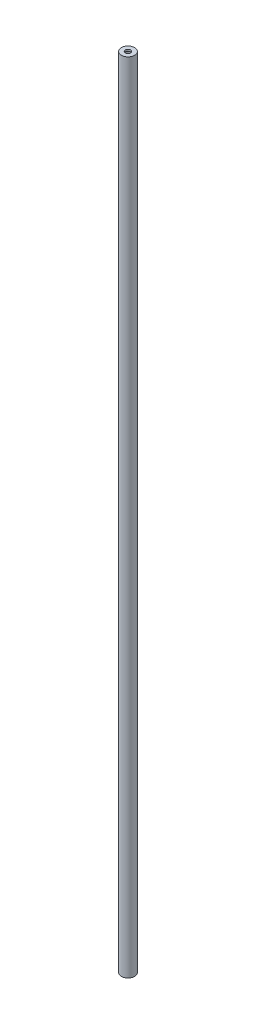
ISO-10303-21;
HEADER;
FILE_DESCRIPTION(('STEP AP214'),'2;1');
FILE_NAME('part.step','',(''),(''),'','','');
FILE_SCHEMA(('AUTOMOTIVE_DESIGN { 1 0 10303 214 1 1 1 1 }'));
ENDSEC;
DATA;
#1=APPLICATION_CONTEXT('core data for automotive mechanical design processes');
#2=APPLICATION_PROTOCOL_DEFINITION('international standard','automotive_design',2000,#1);
#3=PRODUCT_CONTEXT('',#1,'mechanical');
#4=PRODUCT('Part','Part','',(#3));
#5=PRODUCT_RELATED_PRODUCT_CATEGORY('part','',(#4));
#6=PRODUCT_DEFINITION_FORMATION('','',#4);
#7=PRODUCT_DEFINITION_CONTEXT('part definition',#1,'design');
#8=PRODUCT_DEFINITION('design','',#6,#7);
#9=PRODUCT_DEFINITION_SHAPE('','',#8);
#10=(LENGTH_UNIT() NAMED_UNIT(*) SI_UNIT(.MILLI.,.METRE.));
#11=(NAMED_UNIT(*) PLANE_ANGLE_UNIT() SI_UNIT($,.RADIAN.));
#12=(NAMED_UNIT(*) SI_UNIT($,.STERADIAN.) SOLID_ANGLE_UNIT());
#13=UNCERTAINTY_MEASURE_WITH_UNIT(LENGTH_MEASURE(1.E-05),#10,'distance_accuracy_value','');
#14=(GEOMETRIC_REPRESENTATION_CONTEXT(3) GLOBAL_UNCERTAINTY_ASSIGNED_CONTEXT((#13)) GLOBAL_UNIT_ASSIGNED_CONTEXT((#10,
#11,#12)) REPRESENTATION_CONTEXT('',''));
#15=CARTESIAN_POINT('',(0.,0.,0.));
#16=DIRECTION('',(0.,0.,1.));
#17=DIRECTION('',(1.,0.,0.));
#18=AXIS2_PLACEMENT_3D('',#15,#16,#17);
#19=CARTESIAN_POINT('',(0.,900.,0.));
#20=DIRECTION('',(0.,-1.,0.));
#21=DIRECTION('',(0.,0.,-1.));
#22=AXIS2_PLACEMENT_3D('',#19,#20,#21);
#23=CYLINDRICAL_SURFACE('',#22,5.5);
#24=CARTESIAN_POINT('',(0.,898.,0.));
#25=DIRECTION('',(0.,1.,0.));
#26=DIRECTION('',(0.,0.,1.));
#27=AXIS2_PLACEMENT_3D('',#24,#25,#26);
#28=CIRCLE('',#27,5.5);
#29=CARTESIAN_POINT('',(0.,898.,5.5));
#30=VERTEX_POINT('',#29);
#31=EDGE_CURVE('E10',#30,#30,#28,.T.);
#32=ORIENTED_EDGE('',*,*,#31,.T.);
#33=EDGE_LOOP('',(#32));
#34=FACE_BOUND('',#33,.T.);
#35=CARTESIAN_POINT('',(0.,2.,0.));
#36=DIRECTION('',(0.,1.,0.));
#37=DIRECTION('',(0.,0.,1.));
#38=AXIS2_PLACEMENT_3D('',#35,#36,#37);
#39=CIRCLE('',#38,5.5);
#40=CARTESIAN_POINT('',(0.,2.,5.5));
#41=VERTEX_POINT('',#40);
#42=EDGE_CURVE('E51',#41,#41,#39,.T.);
#43=ORIENTED_EDGE('',*,*,#42,.F.);
#44=EDGE_LOOP('',(#43));
#45=FACE_BOUND('',#44,.T.);
#46=ADVANCED_FACE('F43',(#34,#45),#23,.F.);
#47=CARTESIAN_POINT('',(0.,898.,0.));
#48=DIRECTION('',(0.,1.,0.));
#49=DIRECTION('',(0.,0.,1.));
#50=AXIS2_PLACEMENT_3D('',#47,#48,#49);
#51=PLANE('',#50);
#52=CARTESIAN_POINT('',(0.,898.,0.));
#53=DIRECTION('',(0.,1.,0.));
#54=DIRECTION('',(0.,0.,1.));
#55=AXIS2_PLACEMENT_3D('',#52,#53,#54);
#56=CIRCLE('',#55,3.);
#57=CARTESIAN_POINT('',(0.,898.,3.));
#58=VERTEX_POINT('',#57);
#59=EDGE_CURVE('E66',#58,#58,#56,.T.);
#60=ORIENTED_EDGE('',*,*,#59,.T.);
#61=EDGE_LOOP('',(#60));
#62=FACE_BOUND('',#61,.T.);
#63=ORIENTED_EDGE('',*,*,#31,.F.);
#64=EDGE_LOOP('',(#63));
#65=FACE_BOUND('',#64,.T.);
#66=ADVANCED_FACE('F81',(#62,#65),#51,.F.);
#67=CARTESIAN_POINT('',(0.,2.,0.));
#68=DIRECTION('',(0.,1.,0.));
#69=DIRECTION('',(0.,0.,1.));
#70=AXIS2_PLACEMENT_3D('',#67,#68,#69);
#71=PLANE('',#70);
#72=CARTESIAN_POINT('',(0.,2.,0.));
#73=DIRECTION('',(0.,1.,0.));
#74=DIRECTION('',(0.,0.,1.));
#75=AXIS2_PLACEMENT_3D('',#72,#73,#74);
#76=CIRCLE('',#75,3.);
#77=CARTESIAN_POINT('',(0.,2.,3.));
#78=VERTEX_POINT('',#77);
#79=EDGE_CURVE('E47',#78,#78,#76,.T.);
#80=ORIENTED_EDGE('',*,*,#79,.F.);
#81=EDGE_LOOP('',(#80));
#82=FACE_BOUND('',#81,.T.);
#83=ORIENTED_EDGE('',*,*,#42,.T.);
#84=EDGE_LOOP('',(#83));
#85=FACE_BOUND('',#84,.T.);
#86=ADVANCED_FACE('F45',(#82,#85),#71,.T.);
#87=CARTESIAN_POINT('',(0.,0.,0.));
#88=DIRECTION('',(0.,1.,0.));
#89=DIRECTION('',(0.,0.,1.));
#90=AXIS2_PLACEMENT_3D('',#87,#88,#89);
#91=CYLINDRICAL_SURFACE('',#90,3.);
#92=ORIENTED_EDGE('',*,*,#79,.T.);
#93=EDGE_LOOP('',(#92));
#94=FACE_BOUND('',#93,.T.);
#95=CARTESIAN_POINT('',(0.,0.,0.));
#96=DIRECTION('',(0.,1.,0.));
#97=DIRECTION('',(0.,0.,1.));
#98=AXIS2_PLACEMENT_3D('',#95,#96,#97);
#99=CIRCLE('',#98,3.);
#100=CARTESIAN_POINT('',(0.,0.,3.));
#101=VERTEX_POINT('',#100);
#102=EDGE_CURVE('E69',#101,#101,#99,.T.);
#103=ORIENTED_EDGE('',*,*,#102,.F.);
#104=EDGE_LOOP('',(#103));
#105=FACE_BOUND('',#104,.T.);
#106=ADVANCED_FACE('F76',(#94,#105),#91,.F.);
#107=CARTESIAN_POINT('',(0.,900.,0.));
#108=DIRECTION('',(0.,1.,0.));
#109=DIRECTION('',(0.,0.,1.));
#110=AXIS2_PLACEMENT_3D('',#107,#108,#109);
#111=CIRCLE('',#110,3.);
#112=CARTESIAN_POINT('',(0.,900.,3.));
#113=VERTEX_POINT('',#112);
#114=EDGE_CURVE('E61',#113,#113,#111,.T.);
#115=ORIENTED_EDGE('',*,*,#114,.T.);
#116=EDGE_LOOP('',(#115));
#117=FACE_BOUND('',#116,.T.);
#118=ORIENTED_EDGE('',*,*,#59,.F.);
#119=EDGE_LOOP('',(#118));
#120=FACE_BOUND('',#119,.T.);
#121=ADVANCED_FACE('F96',(#117,#120),#91,.F.);
#122=CARTESIAN_POINT('',(0.,900.,0.));
#123=DIRECTION('',(0.,-1.,0.));
#124=DIRECTION('',(0.,0.,-1.));
#125=AXIS2_PLACEMENT_3D('',#122,#123,#124);
#126=CYLINDRICAL_SURFACE('',#125,7.5);
#127=CARTESIAN_POINT('',(0.,900.,0.));
#128=DIRECTION('',(0.,1.,0.));
#129=DIRECTION('',(0.,0.,1.));
#130=AXIS2_PLACEMENT_3D('',#127,#128,#129);
#131=CIRCLE('',#130,7.5);
#132=CARTESIAN_POINT('',(0.,900.,7.5));
#133=VERTEX_POINT('',#132);
#134=EDGE_CURVE('E56',#133,#133,#131,.T.);
#135=ORIENTED_EDGE('',*,*,#134,.F.);
#136=EDGE_LOOP('',(#135));
#137=FACE_BOUND('',#136,.T.);
#138=CARTESIAN_POINT('',(0.,0.,0.));
#139=DIRECTION('',(0.,1.,0.));
#140=DIRECTION('',(0.,0.,1.));
#141=AXIS2_PLACEMENT_3D('',#138,#139,#140);
#142=CIRCLE('',#141,7.5);
#143=CARTESIAN_POINT('',(0.,0.,7.5));
#144=VERTEX_POINT('',#143);
#145=EDGE_CURVE('E58',#144,#144,#142,.T.);
#146=ORIENTED_EDGE('',*,*,#145,.T.);
#147=EDGE_LOOP('',(#146));
#148=FACE_BOUND('',#147,.T.);
#149=ADVANCED_FACE('F93',(#137,#148),#126,.T.);
#150=CARTESIAN_POINT('',(0.,900.,0.));
#151=DIRECTION('',(0.,1.,0.));
#152=DIRECTION('',(0.,0.,1.));
#153=AXIS2_PLACEMENT_3D('',#150,#151,#152);
#154=PLANE('',#153);
#155=ORIENTED_EDGE('',*,*,#114,.F.);
#156=EDGE_LOOP('',(#155));
#157=FACE_BOUND('',#156,.T.);
#158=ORIENTED_EDGE('',*,*,#134,.T.);
#159=EDGE_LOOP('',(#158));
#160=FACE_BOUND('',#159,.T.);
#161=ADVANCED_FACE('F95',(#157,#160),#154,.T.);
#162=CARTESIAN_POINT('',(0.,0.,0.));
#163=DIRECTION('',(0.,1.,0.));
#164=DIRECTION('',(0.,0.,1.));
#165=AXIS2_PLACEMENT_3D('',#162,#163,#164);
#166=PLANE('',#165);
#167=ORIENTED_EDGE('',*,*,#102,.T.);
#168=EDGE_LOOP('',(#167));
#169=FACE_BOUND('',#168,.T.);
#170=ORIENTED_EDGE('',*,*,#145,.F.);
#171=EDGE_LOOP('',(#170));
#172=FACE_BOUND('',#171,.T.);
#173=ADVANCED_FACE('F98',(#169,#172),#166,.F.);
#174=CLOSED_SHELL('',(#46,#66,#86,#106,#121,#149,#161,#173));
#175=MANIFOLD_SOLID_BREP('B2',#174);
#176=ADVANCED_BREP_SHAPE_REPRESENTATION('',(#18,#175),#14);
#177=SHAPE_DEFINITION_REPRESENTATION(#9,#176);
ENDSEC;
END-ISO-10303-21;
